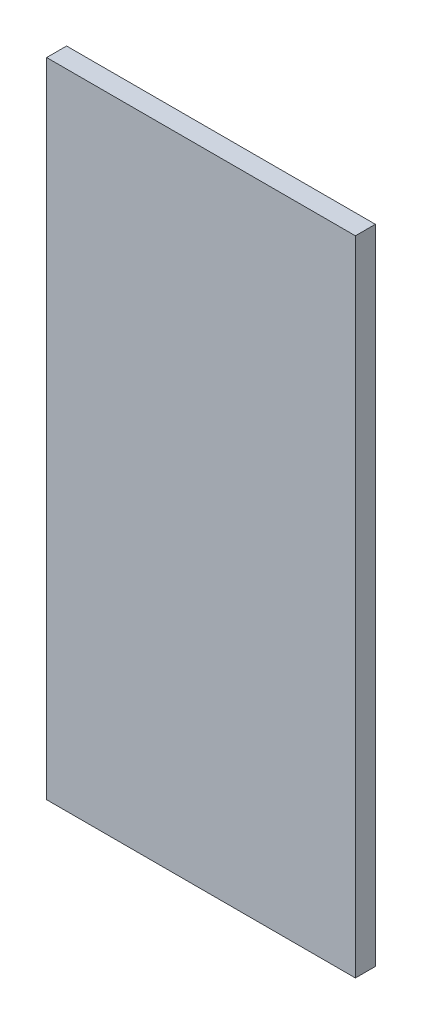
ISO-10303-21;
HEADER;
FILE_DESCRIPTION(('STEP AP214'),'2;1');
FILE_NAME('part.step','',(''),(''),'','','');
FILE_SCHEMA(('AUTOMOTIVE_DESIGN { 1 0 10303 214 1 1 1 1 }'));
ENDSEC;
DATA;
#1=APPLICATION_CONTEXT('core data for automotive mechanical design processes');
#2=APPLICATION_PROTOCOL_DEFINITION('international standard','automotive_design',2000,#1);
#3=PRODUCT_CONTEXT('',#1,'mechanical');
#4=PRODUCT('Part','Part','',(#3));
#5=PRODUCT_RELATED_PRODUCT_CATEGORY('part','',(#4));
#6=PRODUCT_DEFINITION_FORMATION('','',#4);
#7=PRODUCT_DEFINITION_CONTEXT('part definition',#1,'design');
#8=PRODUCT_DEFINITION('design','',#6,#7);
#9=PRODUCT_DEFINITION_SHAPE('','',#8);
#10=(LENGTH_UNIT() NAMED_UNIT(*) SI_UNIT(.MILLI.,.METRE.));
#11=(NAMED_UNIT(*) PLANE_ANGLE_UNIT() SI_UNIT($,.RADIAN.));
#12=(NAMED_UNIT(*) SI_UNIT($,.STERADIAN.) SOLID_ANGLE_UNIT());
#13=UNCERTAINTY_MEASURE_WITH_UNIT(LENGTH_MEASURE(1.E-05),#10,'distance_accuracy_value','');
#14=(GEOMETRIC_REPRESENTATION_CONTEXT(3) GLOBAL_UNCERTAINTY_ASSIGNED_CONTEXT((#13)) GLOBAL_UNIT_ASSIGNED_CONTEXT((#10,
#11,#12)) REPRESENTATION_CONTEXT('',''));
#15=CARTESIAN_POINT('',(0.,0.,0.));
#16=DIRECTION('',(0.,0.,1.));
#17=DIRECTION('',(1.,0.,0.));
#18=AXIS2_PLACEMENT_3D('',#15,#16,#17);
#19=CARTESIAN_POINT('',(90.2419967651367,100.66300201416,0.));
#20=DIRECTION('',(1.,0.,0.));
#21=DIRECTION('',(0.,-1.,0.));
#22=AXIS2_PLACEMENT_3D('',#19,#20,#21);
#23=PLANE('',#22);
#24=DIRECTION('',(0.,-1.,0.));
#25=VECTOR('',#24,1.);
#26=CARTESIAN_POINT('',(90.2419967651367,100.66300201416,0.03556));
#27=LINE('',#26,#25);
#28=CARTESIAN_POINT('',(90.2419967651367,100.66300201416,0.03556));
#29=VERTEX_POINT('',#28);
#30=CARTESIAN_POINT('',(90.2419967651367,99.5179977416992,0.03556));
#31=VERTEX_POINT('',#30);
#32=EDGE_CURVE('E11',#29,#31,#27,.T.);
#33=ORIENTED_EDGE('',*,*,#32,.F.);
#34=DIRECTION('',(0.,0.,1.));
#35=VECTOR('',#34,1.);
#36=CARTESIAN_POINT('',(90.2419967651367,100.66300201416,0.));
#37=LINE('',#36,#35);
#38=CARTESIAN_POINT('',(90.2419967651367,100.66300201416,0.));
#39=VERTEX_POINT('',#38);
#40=EDGE_CURVE('E24',#39,#29,#37,.T.);
#41=ORIENTED_EDGE('',*,*,#40,.F.);
#42=DIRECTION('',(0.,-1.,0.));
#43=VECTOR('',#42,1.);
#44=CARTESIAN_POINT('',(90.2419967651367,100.66300201416,0.));
#45=LINE('',#44,#43);
#46=CARTESIAN_POINT('',(90.2419967651367,99.5179977416992,0.));
#47=VERTEX_POINT('',#46);
#48=EDGE_CURVE('E75',#39,#47,#45,.T.);
#49=ORIENTED_EDGE('',*,*,#48,.T.);
#50=DIRECTION('',(0.,0.,1.));
#51=VECTOR('',#50,1.);
#52=CARTESIAN_POINT('',(90.2419967651367,99.5179977416992,0.));
#53=LINE('',#52,#51);
#54=EDGE_CURVE('E37',#47,#31,#53,.T.);
#55=ORIENTED_EDGE('',*,*,#54,.T.);
#56=EDGE_LOOP('',(#33,#41,#49,#55));
#57=FACE_BOUND('',#56,.T.);
#58=ADVANCED_FACE('F17',(#57),#23,.F.);
#59=CARTESIAN_POINT('',(90.2419967651367,99.5179977416992,0.));
#60=DIRECTION('',(0.,1.,0.));
#61=DIRECTION('',(1.,0.,0.));
#62=AXIS2_PLACEMENT_3D('',#59,#60,#61);
#63=PLANE('',#62);
#64=DIRECTION('',(1.,0.,0.));
#65=VECTOR('',#64,1.);
#66=CARTESIAN_POINT('',(90.2419967651367,99.5179977416992,0.03556));
#67=LINE('',#66,#65);
#68=CARTESIAN_POINT('',(90.7919998168945,99.5179977416992,0.03556));
#69=VERTEX_POINT('',#68);
#70=EDGE_CURVE('E83',#31,#69,#67,.T.);
#71=ORIENTED_EDGE('',*,*,#70,.F.);
#72=ORIENTED_EDGE('',*,*,#54,.F.);
#73=DIRECTION('',(1.,0.,0.));
#74=VECTOR('',#73,1.);
#75=CARTESIAN_POINT('',(90.2419967651367,99.5179977416992,0.));
#76=LINE('',#75,#74);
#77=CARTESIAN_POINT('',(90.7919998168945,99.5179977416992,0.));
#78=VERTEX_POINT('',#77);
#79=EDGE_CURVE('E81',#47,#78,#76,.T.);
#80=ORIENTED_EDGE('',*,*,#79,.T.);
#81=DIRECTION('',(0.,0.,1.));
#82=VECTOR('',#81,1.);
#83=CARTESIAN_POINT('',(90.7919998168945,99.5179977416992,0.));
#84=LINE('',#83,#82);
#85=EDGE_CURVE('E67',#78,#69,#84,.T.);
#86=ORIENTED_EDGE('',*,*,#85,.T.);
#87=EDGE_LOOP('',(#71,#72,#80,#86));
#88=FACE_BOUND('',#87,.T.);
#89=ADVANCED_FACE('F89',(#88),#63,.F.);
#90=CARTESIAN_POINT('',(90.7919998168945,99.5179977416992,0.));
#91=DIRECTION('',(-1.,0.,0.));
#92=DIRECTION('',(0.,1.,0.));
#93=AXIS2_PLACEMENT_3D('',#90,#91,#92);
#94=PLANE('',#93);
#95=DIRECTION('',(0.,1.,0.));
#96=VECTOR('',#95,1.);
#97=CARTESIAN_POINT('',(90.7919998168945,99.5179977416992,0.03556));
#98=LINE('',#97,#96);
#99=CARTESIAN_POINT('',(90.7919998168945,100.66300201416,0.03556));
#100=VERTEX_POINT('',#99);
#101=EDGE_CURVE('E71',#69,#100,#98,.T.);
#102=ORIENTED_EDGE('',*,*,#101,.F.);
#103=ORIENTED_EDGE('',*,*,#85,.F.);
#104=DIRECTION('',(0.,1.,0.));
#105=VECTOR('',#104,1.);
#106=CARTESIAN_POINT('',(90.7919998168945,99.5179977416992,0.));
#107=LINE('',#106,#105);
#108=CARTESIAN_POINT('',(90.7919998168945,100.66300201416,0.));
#109=VERTEX_POINT('',#108);
#110=EDGE_CURVE('E63',#78,#109,#107,.T.);
#111=ORIENTED_EDGE('',*,*,#110,.T.);
#112=DIRECTION('',(0.,0.,1.));
#113=VECTOR('',#112,1.);
#114=CARTESIAN_POINT('',(90.7919998168945,100.66300201416,0.));
#115=LINE('',#114,#113);
#116=EDGE_CURVE('E53',#109,#100,#115,.T.);
#117=ORIENTED_EDGE('',*,*,#116,.T.);
#118=EDGE_LOOP('',(#102,#103,#111,#117));
#119=FACE_BOUND('',#118,.T.);
#120=ADVANCED_FACE('F66',(#119),#94,.F.);
#121=CARTESIAN_POINT('',(90.7919998168945,100.66300201416,0.));
#122=DIRECTION('',(0.,-1.,0.));
#123=DIRECTION('',(-1.,0.,0.));
#124=AXIS2_PLACEMENT_3D('',#121,#122,#123);
#125=PLANE('',#124);
#126=DIRECTION('',(-1.,0.,0.));
#127=VECTOR('',#126,1.);
#128=CARTESIAN_POINT('',(90.7919998168945,100.66300201416,0.03556));
#129=LINE('',#128,#127);
#130=EDGE_CURVE('E59',#100,#29,#129,.T.);
#131=ORIENTED_EDGE('',*,*,#130,.F.);
#132=ORIENTED_EDGE('',*,*,#116,.F.);
#133=DIRECTION('',(-1.,0.,0.));
#134=VECTOR('',#133,1.);
#135=CARTESIAN_POINT('',(90.7919998168945,100.66300201416,0.));
#136=LINE('',#135,#134);
#137=EDGE_CURVE('E57',#109,#39,#136,.T.);
#138=ORIENTED_EDGE('',*,*,#137,.T.);
#139=ORIENTED_EDGE('',*,*,#40,.T.);
#140=EDGE_LOOP('',(#131,#132,#138,#139));
#141=FACE_BOUND('',#140,.T.);
#142=ADVANCED_FACE('F55',(#141),#125,.F.);
#143=CARTESIAN_POINT('',(90.2419967651367,100.66300201416,0.));
#144=DIRECTION('',(0.,0.,-1.));
#145=DIRECTION('',(-1.,0.,0.));
#146=AXIS2_PLACEMENT_3D('',#143,#144,#145);
#147=PLANE('',#146);
#148=ORIENTED_EDGE('',*,*,#137,.F.);
#149=ORIENTED_EDGE('',*,*,#110,.F.);
#150=ORIENTED_EDGE('',*,*,#79,.F.);
#151=ORIENTED_EDGE('',*,*,#48,.F.);
#152=EDGE_LOOP('',(#148,#149,#150,#151));
#153=FACE_BOUND('',#152,.T.);
#154=ADVANCED_FACE('F74',(#153),#147,.T.);
#155=CARTESIAN_POINT('',(90.2419967651367,100.66300201416,0.03556));
#156=DIRECTION('',(0.,0.,-1.));
#157=DIRECTION('',(-1.,0.,0.));
#158=AXIS2_PLACEMENT_3D('',#155,#156,#157);
#159=PLANE('',#158);
#160=ORIENTED_EDGE('',*,*,#32,.T.);
#161=ORIENTED_EDGE('',*,*,#70,.T.);
#162=ORIENTED_EDGE('',*,*,#101,.T.);
#163=ORIENTED_EDGE('',*,*,#130,.T.);
#164=EDGE_LOOP('',(#160,#161,#162,#163));
#165=FACE_BOUND('',#164,.T.);
#166=ADVANCED_FACE('F91',(#165),#159,.F.);
#167=CLOSED_SHELL('',(#58,#89,#120,#142,#154,#166));
#168=MANIFOLD_SOLID_BREP('B1',#167);
#169=ADVANCED_BREP_SHAPE_REPRESENTATION('',(#18,#168),#14);
#170=SHAPE_DEFINITION_REPRESENTATION(#9,#169);
ENDSEC;
END-ISO-10303-21;
